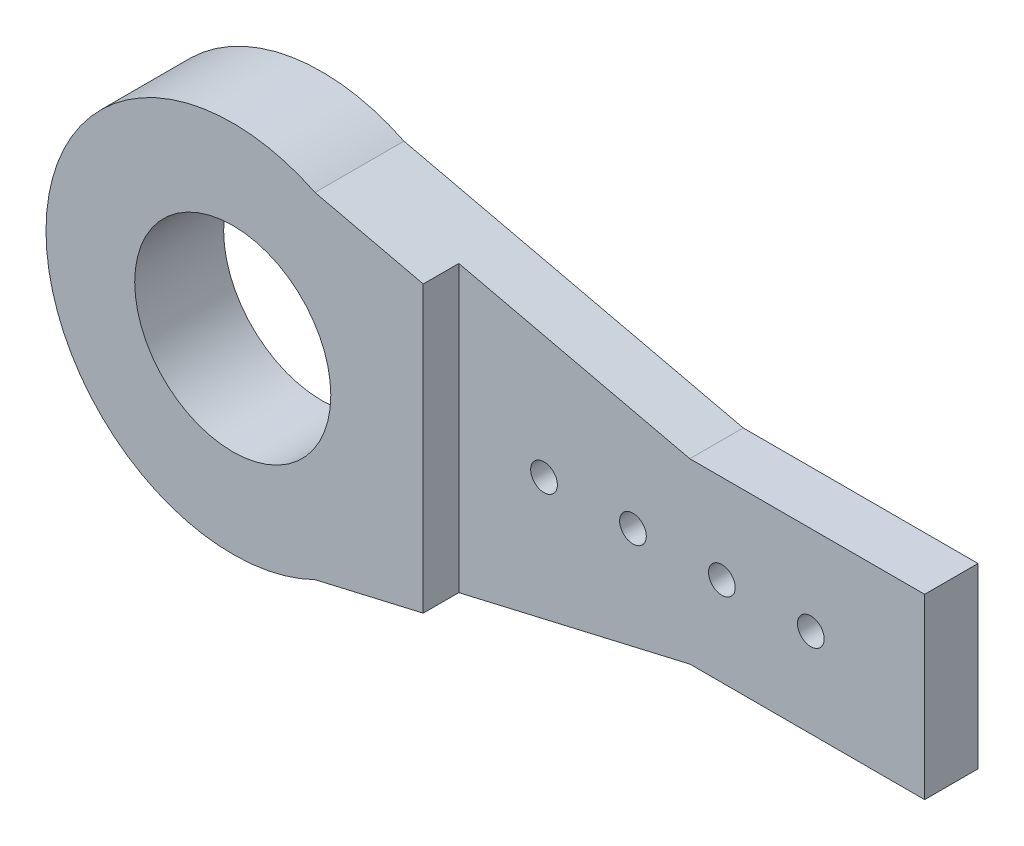
ISO-10303-21;
HEADER;
FILE_DESCRIPTION(('STEP AP214'),'2;1');
FILE_NAME('part.step','',(''),(''),'','','');
FILE_SCHEMA(('AUTOMOTIVE_DESIGN { 1 0 10303 214 1 1 1 1 }'));
ENDSEC;
DATA;
#1=APPLICATION_CONTEXT('core data for automotive mechanical design processes');
#2=APPLICATION_PROTOCOL_DEFINITION('international standard','automotive_design',2000,#1);
#3=PRODUCT_CONTEXT('',#1,'mechanical');
#4=PRODUCT('Part','Part','',(#3));
#5=PRODUCT_RELATED_PRODUCT_CATEGORY('part','',(#4));
#6=PRODUCT_DEFINITION_FORMATION('','',#4);
#7=PRODUCT_DEFINITION_CONTEXT('part definition',#1,'design');
#8=PRODUCT_DEFINITION('design','',#6,#7);
#9=PRODUCT_DEFINITION_SHAPE('','',#8);
#10=(LENGTH_UNIT() NAMED_UNIT(*) SI_UNIT(.MILLI.,.METRE.));
#11=(NAMED_UNIT(*) PLANE_ANGLE_UNIT() SI_UNIT($,.RADIAN.));
#12=(NAMED_UNIT(*) SI_UNIT($,.STERADIAN.) SOLID_ANGLE_UNIT());
#13=UNCERTAINTY_MEASURE_WITH_UNIT(LENGTH_MEASURE(1.E-05),#10,'distance_accuracy_value','');
#14=(GEOMETRIC_REPRESENTATION_CONTEXT(3) GLOBAL_UNCERTAINTY_ASSIGNED_CONTEXT((#13)) GLOBAL_UNIT_ASSIGNED_CONTEXT((#10,
#11,#12)) REPRESENTATION_CONTEXT('',''));
#15=CARTESIAN_POINT('',(0.,0.,0.));
#16=DIRECTION('',(0.,0.,1.));
#17=DIRECTION('',(1.,0.,0.));
#18=AXIS2_PLACEMENT_3D('',#15,#16,#17);
#19=CARTESIAN_POINT('',(26.4,10.,10.));
#20=DIRECTION('',(-1.,0.,0.));
#21=DIRECTION('',(0.,-1.,0.));
#22=AXIS2_PLACEMENT_3D('',#19,#20,#21);
#23=PLANE('',#22);
#24=DIRECTION('',(0.,1.,0.));
#25=VECTOR('',#24,1.);
#26=CARTESIAN_POINT('',(26.4,-10.,6.));
#27=LINE('',#26,#25);
#28=CARTESIAN_POINT('',(26.4,-10.,6.));
#29=VERTEX_POINT('',#28);
#30=CARTESIAN_POINT('',(26.4,10.,6.));
#31=VERTEX_POINT('',#30);
#32=EDGE_CURVE('E90',#29,#31,#27,.T.);
#33=ORIENTED_EDGE('',*,*,#32,.F.);
#34=DIRECTION('',(0.,0.,-1.));
#35=VECTOR('',#34,1.);
#36=CARTESIAN_POINT('',(26.4,-10.,10.));
#37=LINE('',#36,#35);
#38=CARTESIAN_POINT('',(26.4,-10.,0.));
#39=VERTEX_POINT('',#38);
#40=EDGE_CURVE('E83',#29,#39,#37,.T.);
#41=ORIENTED_EDGE('',*,*,#40,.T.);
#42=DIRECTION('',(0.,1.,0.));
#43=VECTOR('',#42,1.);
#44=CARTESIAN_POINT('',(26.4,10.,0.));
#45=LINE('',#44,#43);
#46=CARTESIAN_POINT('',(26.4,10.,0.));
#47=VERTEX_POINT('',#46);
#48=EDGE_CURVE('E87',#39,#47,#45,.T.);
#49=ORIENTED_EDGE('',*,*,#48,.T.);
#50=DIRECTION('',(0.,0.,-1.));
#51=VECTOR('',#50,1.);
#52=CARTESIAN_POINT('',(26.4,10.,10.));
#53=LINE('',#52,#51);
#54=EDGE_CURVE('E11',#31,#47,#53,.T.);
#55=ORIENTED_EDGE('',*,*,#54,.F.);
#56=EDGE_LOOP('',(#33,#41,#49,#55));
#57=FACE_BOUND('',#56,.T.);
#58=ADVANCED_FACE('F33',(#57),#23,.F.);
#59=CARTESIAN_POINT('',(0.,10.,10.));
#60=DIRECTION('',(0.,-1.,0.));
#61=DIRECTION('',(1.,0.,0.));
#62=AXIS2_PLACEMENT_3D('',#59,#60,#61);
#63=PLANE('',#62);
#64=DIRECTION('',(-1.,0.,0.));
#65=VECTOR('',#64,1.);
#66=CARTESIAN_POINT('',(26.4,10.,6.));
#67=LINE('',#66,#65);
#68=CARTESIAN_POINT('',(0.,10.,6.));
#69=VERTEX_POINT('',#68);
#70=EDGE_CURVE('E190',#31,#69,#67,.T.);
#71=ORIENTED_EDGE('',*,*,#70,.F.);
#72=ORIENTED_EDGE('',*,*,#54,.T.);
#73=DIRECTION('',(-1.,0.,0.));
#74=VECTOR('',#73,1.);
#75=CARTESIAN_POINT('',(0.,10.,0.));
#76=LINE('',#75,#74);
#77=CARTESIAN_POINT('',(0.,10.,0.));
#78=VERTEX_POINT('',#77);
#79=EDGE_CURVE('E110',#47,#78,#76,.T.);
#80=ORIENTED_EDGE('',*,*,#79,.T.);
#81=DIRECTION('',(0.,0.,-1.));
#82=VECTOR('',#81,1.);
#83=CARTESIAN_POINT('',(0.,10.,10.));
#84=LINE('',#83,#82);
#85=EDGE_CURVE('E41',#69,#78,#84,.T.);
#86=ORIENTED_EDGE('',*,*,#85,.F.);
#87=EDGE_LOOP('',(#71,#72,#80,#86));
#88=FACE_BOUND('',#87,.T.);
#89=ADVANCED_FACE('F187',(#88),#63,.F.);
#90=CARTESIAN_POINT('',(0.,-10.,10.));
#91=DIRECTION('',(0.,1.,0.));
#92=DIRECTION('',(-1.,0.,0.));
#93=AXIS2_PLACEMENT_3D('',#90,#91,#92);
#94=PLANE('',#93);
#95=DIRECTION('',(1.,0.,0.));
#96=VECTOR('',#95,1.);
#97=CARTESIAN_POINT('',(0.,-10.,6.));
#98=LINE('',#97,#96);
#99=CARTESIAN_POINT('',(0.,-10.,6.));
#100=VERTEX_POINT('',#99);
#101=EDGE_CURVE('E208',#100,#29,#98,.T.);
#102=ORIENTED_EDGE('',*,*,#101,.F.);
#103=DIRECTION('',(0.,0.,-1.));
#104=VECTOR('',#103,1.);
#105=CARTESIAN_POINT('',(0.,-10.,10.));
#106=LINE('',#105,#104);
#107=CARTESIAN_POINT('',(0.,-10.,0.));
#108=VERTEX_POINT('',#107);
#109=EDGE_CURVE('E92',#100,#108,#106,.T.);
#110=ORIENTED_EDGE('',*,*,#109,.T.);
#111=DIRECTION('',(1.,0.,0.));
#112=VECTOR('',#111,1.);
#113=CARTESIAN_POINT('',(0.,-10.,0.));
#114=LINE('',#113,#112);
#115=EDGE_CURVE('E96',#108,#39,#114,.T.);
#116=ORIENTED_EDGE('',*,*,#115,.T.);
#117=ORIENTED_EDGE('',*,*,#40,.F.);
#118=EDGE_LOOP('',(#102,#110,#116,#117));
#119=FACE_BOUND('',#118,.T.);
#120=ADVANCED_FACE('F97',(#119),#94,.F.);
#121=CARTESIAN_POINT('',(-16.4,0.,10.));
#122=DIRECTION('',(0.,0.,-1.));
#123=DIRECTION('',(-1.,0.,0.));
#124=AXIS2_PLACEMENT_3D('',#121,#122,#123);
#125=CYLINDRICAL_SURFACE('',#124,1.5);
#126=CARTESIAN_POINT('',(-16.4,0.,0.));
#127=DIRECTION('',(0.,0.,1.));
#128=DIRECTION('',(1.,0.,0.));
#129=AXIS2_PLACEMENT_3D('',#126,#127,#128);
#130=CIRCLE('',#129,1.5);
#131=CARTESIAN_POINT('',(-14.9,0.,0.));
#132=VERTEX_POINT('',#131);
#133=EDGE_CURVE('E111',#132,#132,#130,.T.);
#134=ORIENTED_EDGE('',*,*,#133,.F.);
#135=EDGE_LOOP('',(#134));
#136=FACE_BOUND('',#135,.T.);
#137=CARTESIAN_POINT('',(-16.4,0.,6.));
#138=DIRECTION('',(0.,0.,1.));
#139=DIRECTION('',(1.,0.,0.));
#140=AXIS2_PLACEMENT_3D('',#137,#138,#139);
#141=CIRCLE('',#140,1.5);
#142=CARTESIAN_POINT('',(-14.9,0.,6.));
#143=VERTEX_POINT('',#142);
#144=EDGE_CURVE('E156',#143,#143,#141,.T.);
#145=ORIENTED_EDGE('',*,*,#144,.T.);
#146=EDGE_LOOP('',(#145));
#147=FACE_BOUND('',#146,.T.);
#148=ADVANCED_FACE('F233',(#136,#147),#125,.F.);
#149=CARTESIAN_POINT('',(-6.39999999999999,0.,10.));
#150=DIRECTION('',(0.,0.,-1.));
#151=DIRECTION('',(-1.,0.,0.));
#152=AXIS2_PLACEMENT_3D('',#149,#150,#151);
#153=CYLINDRICAL_SURFACE('',#152,1.5);
#154=CARTESIAN_POINT('',(-6.39999999999999,0.,0.));
#155=DIRECTION('',(0.,0.,1.));
#156=DIRECTION('',(1.,0.,0.));
#157=AXIS2_PLACEMENT_3D('',#154,#155,#156);
#158=CIRCLE('',#157,1.5);
#159=CARTESIAN_POINT('',(-4.89999999999999,0.,0.));
#160=VERTEX_POINT('',#159);
#161=EDGE_CURVE('E116',#160,#160,#158,.T.);
#162=ORIENTED_EDGE('',*,*,#161,.F.);
#163=EDGE_LOOP('',(#162));
#164=FACE_BOUND('',#163,.T.);
#165=CARTESIAN_POINT('',(-6.39999999999999,0.,6.));
#166=DIRECTION('',(0.,0.,1.));
#167=DIRECTION('',(1.,0.,0.));
#168=AXIS2_PLACEMENT_3D('',#165,#166,#167);
#169=CIRCLE('',#168,1.5);
#170=CARTESIAN_POINT('',(-4.89999999999999,0.,6.));
#171=VERTEX_POINT('',#170);
#172=EDGE_CURVE('E139',#171,#171,#169,.T.);
#173=ORIENTED_EDGE('',*,*,#172,.T.);
#174=EDGE_LOOP('',(#173));
#175=FACE_BOUND('',#174,.T.);
#176=ADVANCED_FACE('F250',(#164,#175),#153,.F.);
#177=CARTESIAN_POINT('',(3.60000000000001,0.,10.));
#178=DIRECTION('',(0.,0.,-1.));
#179=DIRECTION('',(-1.,0.,0.));
#180=AXIS2_PLACEMENT_3D('',#177,#178,#179);
#181=CYLINDRICAL_SURFACE('',#180,1.5);
#182=CARTESIAN_POINT('',(3.60000000000001,0.,0.));
#183=DIRECTION('',(0.,0.,1.));
#184=DIRECTION('',(1.,0.,0.));
#185=AXIS2_PLACEMENT_3D('',#182,#183,#184);
#186=CIRCLE('',#185,1.5);
#187=CARTESIAN_POINT('',(5.10000000000001,0.,0.));
#188=VERTEX_POINT('',#187);
#189=EDGE_CURVE('E162',#188,#188,#186,.T.);
#190=ORIENTED_EDGE('',*,*,#189,.F.);
#191=EDGE_LOOP('',(#190));
#192=FACE_BOUND('',#191,.T.);
#193=CARTESIAN_POINT('',(3.60000000000001,0.,6.));
#194=DIRECTION('',(0.,0.,1.));
#195=DIRECTION('',(1.,0.,0.));
#196=AXIS2_PLACEMENT_3D('',#193,#194,#195);
#197=CIRCLE('',#196,1.5);
#198=CARTESIAN_POINT('',(5.10000000000001,0.,6.));
#199=VERTEX_POINT('',#198);
#200=EDGE_CURVE('E134',#199,#199,#197,.T.);
#201=ORIENTED_EDGE('',*,*,#200,.T.);
#202=EDGE_LOOP('',(#201));
#203=FACE_BOUND('',#202,.T.);
#204=ADVANCED_FACE('F254',(#192,#203),#181,.F.);
#205=CARTESIAN_POINT('',(13.6,0.,10.));
#206=DIRECTION('',(0.,0.,-1.));
#207=DIRECTION('',(-1.,0.,0.));
#208=AXIS2_PLACEMENT_3D('',#205,#206,#207);
#209=CYLINDRICAL_SURFACE('',#208,1.5);
#210=CARTESIAN_POINT('',(13.6,0.,0.));
#211=DIRECTION('',(0.,0.,1.));
#212=DIRECTION('',(1.,0.,0.));
#213=AXIS2_PLACEMENT_3D('',#210,#211,#212);
#214=CIRCLE('',#213,1.5);
#215=CARTESIAN_POINT('',(15.1,0.,0.));
#216=VERTEX_POINT('',#215);
#217=EDGE_CURVE('E159',#216,#216,#214,.T.);
#218=ORIENTED_EDGE('',*,*,#217,.F.);
#219=EDGE_LOOP('',(#218));
#220=FACE_BOUND('',#219,.T.);
#221=CARTESIAN_POINT('',(13.6,0.,6.));
#222=DIRECTION('',(0.,0.,1.));
#223=DIRECTION('',(1.,0.,0.));
#224=AXIS2_PLACEMENT_3D('',#221,#222,#223);
#225=CIRCLE('',#224,1.5);
#226=CARTESIAN_POINT('',(15.1,0.,6.));
#227=VERTEX_POINT('',#226);
#228=EDGE_CURVE('E132',#227,#227,#225,.T.);
#229=ORIENTED_EDGE('',*,*,#228,.T.);
#230=EDGE_LOOP('',(#229));
#231=FACE_BOUND('',#230,.T.);
#232=ADVANCED_FACE('F246',(#220,#231),#209,.F.);
#233=CARTESIAN_POINT('',(-47.4,0.,10.));
#234=DIRECTION('',(0.,0.,1.));
#235=DIRECTION('',(1.,0.,0.));
#236=AXIS2_PLACEMENT_3D('',#233,#234,#235);
#237=PLANE('',#236);
#238=CARTESIAN_POINT('',(-47.4,0.,10.));
#239=DIRECTION('',(0.,0.,1.));
#240=DIRECTION('',(1.,0.,0.));
#241=AXIS2_PLACEMENT_3D('',#238,#239,#240);
#242=CIRCLE('',#241,11.025);
#243=CARTESIAN_POINT('',(-36.375,0.,10.));
#244=VERTEX_POINT('',#243);
#245=EDGE_CURVE('E210',#244,#244,#242,.T.);
#246=ORIENTED_EDGE('',*,*,#245,.F.);
#247=EDGE_LOOP('',(#246));
#248=FACE_BOUND('',#247,.T.);
#249=DIRECTION('',(0.,-1.,0.));
#250=VECTOR('',#249,1.);
#251=CARTESIAN_POINT('',(-25.98,16.0291139240506,10.));
#252=LINE('',#251,#250);
#253=CARTESIAN_POINT('',(-25.98,16.0291139240506,10.));
#254=VERTEX_POINT('',#253);
#255=CARTESIAN_POINT('',(-25.98,-16.0291139240506,10.));
#256=VERTEX_POINT('',#255);
#257=EDGE_CURVE('E151',#254,#256,#252,.T.);
#258=ORIENTED_EDGE('',*,*,#257,.F.);
#259=DIRECTION('',(-0.974113364888029,0.22606006358161,0.));
#260=VECTOR('',#259,1.);
#261=CARTESIAN_POINT('',(-38.1512585735041,18.8536676014461,10.));
#262=LINE('',#261,#260);
#263=CARTESIAN_POINT('',(-38.1512585735041,18.8536676014461,10.));
#264=VERTEX_POINT('',#263);
#265=EDGE_CURVE('E102',#254,#264,#262,.T.);
#266=ORIENTED_EDGE('',*,*,#265,.T.);
#267=CARTESIAN_POINT('',(-47.4,0.,10.));
#268=DIRECTION('',(0.,0.,1.));
#269=DIRECTION('',(1.,0.,0.));
#270=AXIS2_PLACEMENT_3D('',#267,#268,#269);
#271=CIRCLE('',#270,21.);
#272=CARTESIAN_POINT('',(-38.1512585735041,-18.8536676014461,10.));
#273=VERTEX_POINT('',#272);
#274=EDGE_CURVE('E58',#264,#273,#271,.T.);
#275=ORIENTED_EDGE('',*,*,#274,.T.);
#276=DIRECTION('',(0.974113364888029,0.22606006358161,0.));
#277=VECTOR('',#276,1.);
#278=CARTESIAN_POINT('',(-38.1512585735041,-18.8536676014461,10.));
#279=LINE('',#278,#277);
#280=EDGE_CURVE('E93',#273,#256,#279,.T.);
#281=ORIENTED_EDGE('',*,*,#280,.T.);
#282=EDGE_LOOP('',(#258,#266,#275,#281));
#283=FACE_BOUND('',#282,.T.);
#284=ADVANCED_FACE('F168',(#248,#283),#237,.T.);
#285=CARTESIAN_POINT('',(-47.4,0.,0.));
#286=DIRECTION('',(0.,0.,1.));
#287=DIRECTION('',(1.,0.,0.));
#288=AXIS2_PLACEMENT_3D('',#285,#286,#287);
#289=PLANE('',#288);
#290=CARTESIAN_POINT('',(-47.4,0.,0.));
#291=DIRECTION('',(0.,0.,1.));
#292=DIRECTION('',(1.,0.,0.));
#293=AXIS2_PLACEMENT_3D('',#290,#291,#292);
#294=CIRCLE('',#293,11.025);
#295=CARTESIAN_POINT('',(-36.375,0.,0.));
#296=VERTEX_POINT('',#295);
#297=EDGE_CURVE('E36',#296,#296,#294,.T.);
#298=ORIENTED_EDGE('',*,*,#297,.T.);
#299=EDGE_LOOP('',(#298));
#300=FACE_BOUND('',#299,.T.);
#301=ORIENTED_EDGE('',*,*,#48,.F.);
#302=ORIENTED_EDGE('',*,*,#115,.F.);
#303=DIRECTION('',(0.974113364888029,0.22606006358161,0.));
#304=VECTOR('',#303,1.);
#305=CARTESIAN_POINT('',(-38.1512585735041,-18.8536676014461,0.));
#306=LINE('',#305,#304);
#307=CARTESIAN_POINT('',(-38.1512585735041,-18.8536676014461,0.));
#308=VERTEX_POINT('',#307);
#309=EDGE_CURVE('E103',#308,#108,#306,.T.);
#310=ORIENTED_EDGE('',*,*,#309,.F.);
#311=CARTESIAN_POINT('',(-47.4,0.,0.));
#312=DIRECTION('',(0.,0.,1.));
#313=DIRECTION('',(1.,0.,0.));
#314=AXIS2_PLACEMENT_3D('',#311,#312,#313);
#315=CIRCLE('',#314,21.);
#316=CARTESIAN_POINT('',(-38.1512585735041,18.8536676014461,0.));
#317=VERTEX_POINT('',#316);
#318=EDGE_CURVE('E122',#317,#308,#315,.T.);
#319=ORIENTED_EDGE('',*,*,#318,.F.);
#320=DIRECTION('',(-0.974113364888029,0.22606006358161,0.));
#321=VECTOR('',#320,1.);
#322=CARTESIAN_POINT('',(-38.1512585735041,18.8536676014461,0.));
#323=LINE('',#322,#321);
#324=EDGE_CURVE('E113',#78,#317,#323,.T.);
#325=ORIENTED_EDGE('',*,*,#324,.F.);
#326=ORIENTED_EDGE('',*,*,#79,.F.);
#327=EDGE_LOOP('',(#301,#302,#310,#319,#325,#326));
#328=FACE_BOUND('',#327,.T.);
#329=ORIENTED_EDGE('',*,*,#133,.T.);
#330=EDGE_LOOP('',(#329));
#331=FACE_BOUND('',#330,.T.);
#332=ORIENTED_EDGE('',*,*,#161,.T.);
#333=EDGE_LOOP('',(#332));
#334=FACE_BOUND('',#333,.T.);
#335=ORIENTED_EDGE('',*,*,#189,.T.);
#336=EDGE_LOOP('',(#335));
#337=FACE_BOUND('',#336,.T.);
#338=ORIENTED_EDGE('',*,*,#217,.T.);
#339=EDGE_LOOP('',(#338));
#340=FACE_BOUND('',#339,.T.);
#341=ADVANCED_FACE('F106',(#300,#328,#331,#334,#337,#340),#289,.F.);
#342=CARTESIAN_POINT('',(-38.1512585735041,18.8536676014461,10.));
#343=DIRECTION('',(-0.22606006358161,-0.974113364888029,0.));
#344=DIRECTION('',(0.974113364888029,-0.22606006358161,0.));
#345=AXIS2_PLACEMENT_3D('',#342,#343,#344);
#346=PLANE('',#345);
#347=ORIENTED_EDGE('',*,*,#265,.F.);
#348=DIRECTION('',(0.,0.,1.));
#349=VECTOR('',#348,1.);
#350=CARTESIAN_POINT('',(-25.98,16.0291139240506,6.));
#351=LINE('',#350,#349);
#352=CARTESIAN_POINT('',(-25.98,16.0291139240506,6.));
#353=VERTEX_POINT('',#352);
#354=EDGE_CURVE('E142',#353,#254,#351,.T.);
#355=ORIENTED_EDGE('',*,*,#354,.F.);
#356=DIRECTION('',(-0.974113364888029,0.22606006358161,0.));
#357=VECTOR('',#356,1.);
#358=CARTESIAN_POINT('',(0.,10.,6.));
#359=LINE('',#358,#357);
#360=EDGE_CURVE('E184',#69,#353,#359,.T.);
#361=ORIENTED_EDGE('',*,*,#360,.F.);
#362=ORIENTED_EDGE('',*,*,#85,.T.);
#363=ORIENTED_EDGE('',*,*,#324,.T.);
#364=DIRECTION('',(0.,0.,-1.));
#365=VECTOR('',#364,1.);
#366=CARTESIAN_POINT('',(-38.1512585735041,18.8536676014461,10.));
#367=LINE('',#366,#365);
#368=EDGE_CURVE('E129',#264,#317,#367,.T.);
#369=ORIENTED_EDGE('',*,*,#368,.F.);
#370=EDGE_LOOP('',(#347,#355,#361,#362,#363,#369));
#371=FACE_BOUND('',#370,.T.);
#372=ADVANCED_FACE('F178',(#371),#346,.F.);
#373=CARTESIAN_POINT('',(-47.4,0.,10.));
#374=DIRECTION('',(0.,0.,-1.));
#375=DIRECTION('',(-1.,0.,0.));
#376=AXIS2_PLACEMENT_3D('',#373,#374,#375);
#377=CYLINDRICAL_SURFACE('',#376,21.);
#378=ORIENTED_EDGE('',*,*,#318,.T.);
#379=DIRECTION('',(0.,0.,-1.));
#380=VECTOR('',#379,1.);
#381=CARTESIAN_POINT('',(-38.1512585735041,-18.8536676014461,10.));
#382=LINE('',#381,#380);
#383=EDGE_CURVE('E126',#273,#308,#382,.T.);
#384=ORIENTED_EDGE('',*,*,#383,.F.);
#385=ORIENTED_EDGE('',*,*,#274,.F.);
#386=ORIENTED_EDGE('',*,*,#368,.T.);
#387=EDGE_LOOP('',(#378,#384,#385,#386));
#388=FACE_BOUND('',#387,.T.);
#389=ADVANCED_FACE('F175',(#388),#377,.T.);
#390=CARTESIAN_POINT('',(-38.1512585735041,-18.8536676014461,10.));
#391=DIRECTION('',(-0.22606006358161,0.974113364888029,0.));
#392=DIRECTION('',(-0.974113364888029,-0.22606006358161,0.));
#393=AXIS2_PLACEMENT_3D('',#390,#391,#392);
#394=PLANE('',#393);
#395=DIRECTION('',(0.974113364888029,0.22606006358161,0.));
#396=VECTOR('',#395,1.);
#397=CARTESIAN_POINT('',(-25.98,-16.0291139240506,6.));
#398=LINE('',#397,#396);
#399=CARTESIAN_POINT('',(-25.98,-16.0291139240506,6.));
#400=VERTEX_POINT('',#399);
#401=EDGE_CURVE('E49',#400,#100,#398,.T.);
#402=ORIENTED_EDGE('',*,*,#401,.F.);
#403=DIRECTION('',(0.,0.,1.));
#404=VECTOR('',#403,1.);
#405=CARTESIAN_POINT('',(-25.98,-16.0291139240506,6.));
#406=LINE('',#405,#404);
#407=EDGE_CURVE('E135',#400,#256,#406,.T.);
#408=ORIENTED_EDGE('',*,*,#407,.T.);
#409=ORIENTED_EDGE('',*,*,#280,.F.);
#410=ORIENTED_EDGE('',*,*,#383,.T.);
#411=ORIENTED_EDGE('',*,*,#309,.T.);
#412=ORIENTED_EDGE('',*,*,#109,.F.);
#413=EDGE_LOOP('',(#402,#408,#409,#410,#411,#412));
#414=FACE_BOUND('',#413,.T.);
#415=ADVANCED_FACE('F172',(#414),#394,.F.);
#416=CARTESIAN_POINT('',(-25.98,16.0291139240506,6.));
#417=DIRECTION('',(-1.,0.,0.));
#418=DIRECTION('',(0.,-1.,0.));
#419=AXIS2_PLACEMENT_3D('',#416,#417,#418);
#420=PLANE('',#419);
#421=ORIENTED_EDGE('',*,*,#257,.T.);
#422=ORIENTED_EDGE('',*,*,#407,.F.);
#423=DIRECTION('',(0.,-1.,0.));
#424=VECTOR('',#423,1.);
#425=CARTESIAN_POINT('',(-25.98,16.0291139240506,6.));
#426=LINE('',#425,#424);
#427=EDGE_CURVE('E201',#353,#400,#426,.T.);
#428=ORIENTED_EDGE('',*,*,#427,.F.);
#429=ORIENTED_EDGE('',*,*,#354,.T.);
#430=EDGE_LOOP('',(#421,#422,#428,#429));
#431=FACE_BOUND('',#430,.T.);
#432=ADVANCED_FACE('F200',(#431),#420,.F.);
#433=CARTESIAN_POINT('',(0.,0.,6.));
#434=DIRECTION('',(0.,0.,1.));
#435=DIRECTION('',(1.,0.,0.));
#436=AXIS2_PLACEMENT_3D('',#433,#434,#435);
#437=PLANE('',#436);
#438=ORIENTED_EDGE('',*,*,#144,.F.);
#439=EDGE_LOOP('',(#438));
#440=FACE_BOUND('',#439,.T.);
#441=ORIENTED_EDGE('',*,*,#172,.F.);
#442=EDGE_LOOP('',(#441));
#443=FACE_BOUND('',#442,.T.);
#444=ORIENTED_EDGE('',*,*,#200,.F.);
#445=EDGE_LOOP('',(#444));
#446=FACE_BOUND('',#445,.T.);
#447=ORIENTED_EDGE('',*,*,#228,.F.);
#448=EDGE_LOOP('',(#447));
#449=FACE_BOUND('',#448,.T.);
#450=ORIENTED_EDGE('',*,*,#101,.T.);
#451=ORIENTED_EDGE('',*,*,#32,.T.);
#452=ORIENTED_EDGE('',*,*,#70,.T.);
#453=ORIENTED_EDGE('',*,*,#360,.T.);
#454=ORIENTED_EDGE('',*,*,#427,.T.);
#455=ORIENTED_EDGE('',*,*,#401,.T.);
#456=EDGE_LOOP('',(#450,#451,#452,#453,#454,#455));
#457=FACE_BOUND('',#456,.T.);
#458=ADVANCED_FACE('F203',(#440,#443,#446,#449,#457),#437,.T.);
#459=CARTESIAN_POINT('',(-47.4,0.,-59.));
#460=DIRECTION('',(0.,0.,1.));
#461=DIRECTION('',(1.,0.,0.));
#462=AXIS2_PLACEMENT_3D('',#459,#460,#461);
#463=CYLINDRICAL_SURFACE('',#462,11.025);
#464=ORIENTED_EDGE('',*,*,#245,.T.);
#465=EDGE_LOOP('',(#464));
#466=FACE_BOUND('',#465,.T.);
#467=ORIENTED_EDGE('',*,*,#297,.F.);
#468=EDGE_LOOP('',(#467));
#469=FACE_BOUND('',#468,.T.);
#470=ADVANCED_FACE('F218',(#466,#469),#463,.F.);
#471=CLOSED_SHELL('',(#58,#89,#120,#148,#176,#204,#232,#284,#341,#372,#389,#415,#432,#458,#470));
#472=MANIFOLD_SOLID_BREP('B2',#471);
#473=ADVANCED_BREP_SHAPE_REPRESENTATION('',(#18,#472),#14);
#474=SHAPE_DEFINITION_REPRESENTATION(#9,#473);
ENDSEC;
END-ISO-10303-21;
